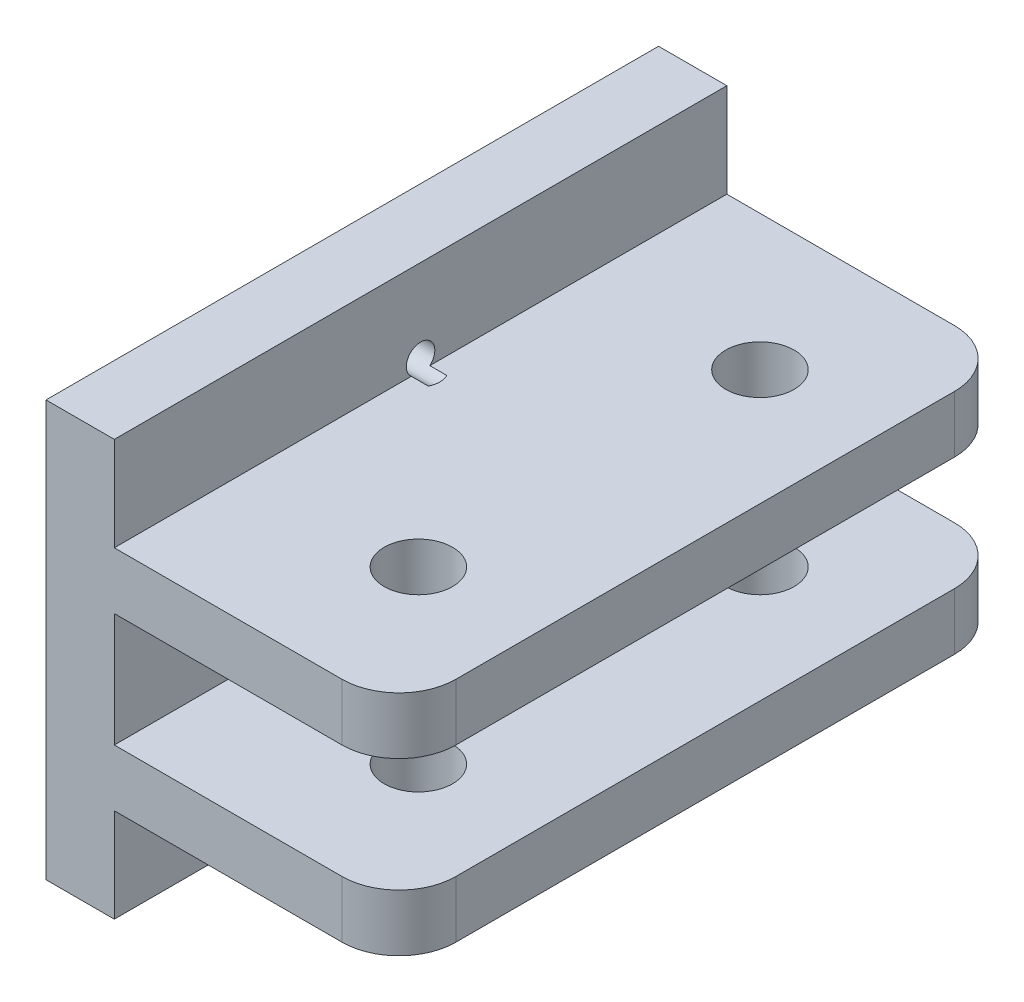
ISO-10303-21;
HEADER;
FILE_DESCRIPTION(('STEP AP214'),'2;1');
FILE_NAME('part.step','',(''),(''),'','','');
FILE_SCHEMA(('AUTOMOTIVE_DESIGN { 1 0 10303 214 1 1 1 1 }'));
ENDSEC;
DATA;
#1=APPLICATION_CONTEXT('core data for automotive mechanical design processes');
#2=APPLICATION_PROTOCOL_DEFINITION('international standard','automotive_design',2000,#1);
#3=PRODUCT_CONTEXT('',#1,'mechanical');
#4=PRODUCT('Part','Part','',(#3));
#5=PRODUCT_RELATED_PRODUCT_CATEGORY('part','',(#4));
#6=PRODUCT_DEFINITION_FORMATION('','',#4);
#7=PRODUCT_DEFINITION_CONTEXT('part definition',#1,'design');
#8=PRODUCT_DEFINITION('design','',#6,#7);
#9=PRODUCT_DEFINITION_SHAPE('','',#8);
#10=(LENGTH_UNIT() NAMED_UNIT(*) SI_UNIT(.MILLI.,.METRE.));
#11=(NAMED_UNIT(*) PLANE_ANGLE_UNIT() SI_UNIT($,.RADIAN.));
#12=(NAMED_UNIT(*) SI_UNIT($,.STERADIAN.) SOLID_ANGLE_UNIT());
#13=UNCERTAINTY_MEASURE_WITH_UNIT(LENGTH_MEASURE(1.E-05),#10,'distance_accuracy_value','');
#14=(GEOMETRIC_REPRESENTATION_CONTEXT(3) GLOBAL_UNCERTAINTY_ASSIGNED_CONTEXT((#13)) GLOBAL_UNIT_ASSIGNED_CONTEXT((#10,
#11,#12)) REPRESENTATION_CONTEXT('',''));
#15=CARTESIAN_POINT('',(0.,0.,0.));
#16=DIRECTION('',(0.,0.,1.));
#17=DIRECTION('',(1.,0.,0.));
#18=AXIS2_PLACEMENT_3D('',#15,#16,#17);
#19=CARTESIAN_POINT('',(31.,0.,0.));
#20=DIRECTION('',(1.,0.,0.));
#21=DIRECTION('',(0.,0.,-1.));
#22=AXIS2_PLACEMENT_3D('',#19,#20,#21);
#23=PLANE('',#22);
#24=DIRECTION('',(0.,0.,1.));
#25=VECTOR('',#24,1.);
#26=CARTESIAN_POINT('',(31.,10.,26.9));
#27=LINE('',#26,#25);
#28=CARTESIAN_POINT('',(31.,10.,-21.9));
#29=VERTEX_POINT('',#28);
#30=CARTESIAN_POINT('',(31.,10.,21.9));
#31=VERTEX_POINT('',#30);
#32=EDGE_CURVE('E252',#29,#31,#27,.T.);
#33=ORIENTED_EDGE('',*,*,#32,.T.);
#34=DIRECTION('',(0.,-1.,0.));
#35=VECTOR('',#34,1.);
#36=CARTESIAN_POINT('',(31.,5.,21.9));
#37=LINE('',#36,#35);
#38=CARTESIAN_POINT('',(31.,5.,21.9));
#39=VERTEX_POINT('',#38);
#40=EDGE_CURVE('E244',#31,#39,#37,.T.);
#41=ORIENTED_EDGE('',*,*,#40,.T.);
#42=DIRECTION('',(0.,0.,1.));
#43=VECTOR('',#42,1.);
#44=CARTESIAN_POINT('',(31.,5.,-26.9));
#45=LINE('',#44,#43);
#46=CARTESIAN_POINT('',(31.,5.,-21.9));
#47=VERTEX_POINT('',#46);
#48=EDGE_CURVE('E269',#47,#39,#45,.T.);
#49=ORIENTED_EDGE('',*,*,#48,.F.);
#50=DIRECTION('',(0.,1.,0.));
#51=VECTOR('',#50,1.);
#52=CARTESIAN_POINT('',(31.,10.,-21.9));
#53=LINE('',#52,#51);
#54=EDGE_CURVE('E242',#47,#29,#53,.T.);
#55=ORIENTED_EDGE('',*,*,#54,.T.);
#56=EDGE_LOOP('',(#33,#41,#49,#55));
#57=FACE_BOUND('',#56,.T.);
#58=ADVANCED_FACE('F39',(#57),#23,.T.);
#59=CARTESIAN_POINT('',(6.,0.,0.));
#60=DIRECTION('',(1.,0.,0.));
#61=DIRECTION('',(0.,0.,-1.));
#62=AXIS2_PLACEMENT_3D('',#59,#60,#61);
#63=PLANE('',#62);
#64=CARTESIAN_POINT('',(6.,-10.95,1.11022302462516E-13));
#65=DIRECTION('',(1.,0.,0.));
#66=DIRECTION('',(0.,0.,-1.));
#67=AXIS2_PLACEMENT_3D('',#64,#65,#66);
#68=CIRCLE('',#67,1.25);
#69=CARTESIAN_POINT('',(6.,-10.,0.812403840463655));
#70=VERTEX_POINT('',#69);
#71=CARTESIAN_POINT('',(6.,-10.,-0.812403840463433));
#72=VERTEX_POINT('',#71);
#73=EDGE_CURVE('E457',#70,#72,#68,.T.);
#74=ORIENTED_EDGE('',*,*,#73,.F.);
#75=DIRECTION('',(0.,0.,-1.));
#76=VECTOR('',#75,1.);
#77=CARTESIAN_POINT('',(6.,-10.,26.9));
#78=LINE('',#77,#76);
#79=CARTESIAN_POINT('',(6.,-10.,26.9));
#80=VERTEX_POINT('',#79);
#81=EDGE_CURVE('E296',#80,#70,#78,.T.);
#82=ORIENTED_EDGE('',*,*,#81,.F.);
#83=DIRECTION('',(0.,-1.,0.));
#84=VECTOR('',#83,1.);
#85=CARTESIAN_POINT('',(6.,-18.25,26.9));
#86=LINE('',#85,#84);
#87=CARTESIAN_POINT('',(6.,-18.25,26.9));
#88=VERTEX_POINT('',#87);
#89=EDGE_CURVE('E312',#80,#88,#86,.T.);
#90=ORIENTED_EDGE('',*,*,#89,.T.);
#91=DIRECTION('',(0.,0.,-1.));
#92=VECTOR('',#91,1.);
#93=CARTESIAN_POINT('',(6.,-18.25,-26.9));
#94=LINE('',#93,#92);
#95=CARTESIAN_POINT('',(6.,-18.25,-26.9));
#96=VERTEX_POINT('',#95);
#97=EDGE_CURVE('E311',#88,#96,#94,.T.);
#98=ORIENTED_EDGE('',*,*,#97,.T.);
#99=DIRECTION('',(0.,1.,0.));
#100=VECTOR('',#99,1.);
#101=CARTESIAN_POINT('',(6.,-18.25,-26.9));
#102=LINE('',#101,#100);
#103=CARTESIAN_POINT('',(6.,-10.,-26.9));
#104=VERTEX_POINT('',#103);
#105=EDGE_CURVE('E314',#96,#104,#102,.T.);
#106=ORIENTED_EDGE('',*,*,#105,.T.);
#107=EDGE_CURVE('E301',#72,#104,#78,.T.);
#108=ORIENTED_EDGE('',*,*,#107,.F.);
#109=EDGE_LOOP('',(#74,#82,#90,#98,#106,#108));
#110=FACE_BOUND('',#109,.T.);
#111=ADVANCED_FACE('F371',(#110),#63,.T.);
#112=CARTESIAN_POINT('',(6.,-18.25,26.9));
#113=DIRECTION('',(0.,0.,-1.));
#114=DIRECTION('',(-1.,0.,0.));
#115=AXIS2_PLACEMENT_3D('',#112,#113,#114);
#116=PLANE('',#115);
#117=DIRECTION('',(-1.,0.,0.));
#118=VECTOR('',#117,1.);
#119=CARTESIAN_POINT('',(31.,-10.,26.9));
#120=LINE('',#119,#118);
#121=CARTESIAN_POINT('',(26.,-10.,26.9));
#122=VERTEX_POINT('',#121);
#123=EDGE_CURVE('E305',#122,#80,#120,.T.);
#124=ORIENTED_EDGE('',*,*,#123,.F.);
#125=DIRECTION('',(0.,-1.,0.));
#126=VECTOR('',#125,1.);
#127=CARTESIAN_POINT('',(26.,-5.,26.9));
#128=LINE('',#127,#126);
#129=CARTESIAN_POINT('',(26.,-5.,26.9));
#130=VERTEX_POINT('',#129);
#131=EDGE_CURVE('E240',#122,#130,#128,.F.);
#132=ORIENTED_EDGE('',*,*,#131,.T.);
#133=DIRECTION('',(1.,0.,0.));
#134=VECTOR('',#133,1.);
#135=CARTESIAN_POINT('',(-48.7214765882647,-5.,26.9));
#136=LINE('',#135,#134);
#137=CARTESIAN_POINT('',(6.,-5.,26.9));
#138=VERTEX_POINT('',#137);
#139=EDGE_CURVE('E273',#138,#130,#136,.T.);
#140=ORIENTED_EDGE('',*,*,#139,.F.);
#141=DIRECTION('',(0.,1.,0.));
#142=VECTOR('',#141,1.);
#143=CARTESIAN_POINT('',(6.,-5.,26.9));
#144=LINE('',#143,#142);
#145=CARTESIAN_POINT('',(6.,5.,26.9));
#146=VERTEX_POINT('',#145);
#147=EDGE_CURVE('E293',#138,#146,#144,.T.);
#148=ORIENTED_EDGE('',*,*,#147,.T.);
#149=DIRECTION('',(1.,0.,0.));
#150=VECTOR('',#149,1.);
#151=CARTESIAN_POINT('',(-48.7214765882647,5.,26.9));
#152=LINE('',#151,#150);
#153=CARTESIAN_POINT('',(26.,5.,26.9));
#154=VERTEX_POINT('',#153);
#155=EDGE_CURVE('E284',#146,#154,#152,.T.);
#156=ORIENTED_EDGE('',*,*,#155,.T.);
#157=DIRECTION('',(0.,-1.,0.));
#158=VECTOR('',#157,1.);
#159=CARTESIAN_POINT('',(26.,10.,26.9));
#160=LINE('',#159,#158);
#161=CARTESIAN_POINT('',(26.,10.,26.9));
#162=VERTEX_POINT('',#161);
#163=EDGE_CURVE('E238',#154,#162,#160,.F.);
#164=ORIENTED_EDGE('',*,*,#163,.T.);
#165=DIRECTION('',(-1.,0.,0.));
#166=VECTOR('',#165,1.);
#167=CARTESIAN_POINT('',(31.,10.,26.9));
#168=LINE('',#167,#166);
#169=CARTESIAN_POINT('',(6.,10.,26.9));
#170=VERTEX_POINT('',#169);
#171=EDGE_CURVE('E262',#162,#170,#168,.T.);
#172=ORIENTED_EDGE('',*,*,#171,.T.);
#173=CARTESIAN_POINT('',(6.,18.25,26.9));
#174=VERTEX_POINT('',#173);
#175=EDGE_CURVE('E308',#174,#170,#86,.T.);
#176=ORIENTED_EDGE('',*,*,#175,.F.);
#177=DIRECTION('',(-1.,0.,0.));
#178=VECTOR('',#177,1.);
#179=CARTESIAN_POINT('',(6.,18.25,26.9));
#180=LINE('',#179,#178);
#181=CARTESIAN_POINT('',(0.,18.25,26.9));
#182=VERTEX_POINT('',#181);
#183=EDGE_CURVE('E319',#174,#182,#180,.T.);
#184=ORIENTED_EDGE('',*,*,#183,.T.);
#185=DIRECTION('',(0.,-1.,0.));
#186=VECTOR('',#185,1.);
#187=CARTESIAN_POINT('',(0.,-18.25,26.9));
#188=LINE('',#187,#186);
#189=CARTESIAN_POINT('',(0.,-18.25,26.9));
#190=VERTEX_POINT('',#189);
#191=EDGE_CURVE('E261',#182,#190,#188,.T.);
#192=ORIENTED_EDGE('',*,*,#191,.T.);
#193=DIRECTION('',(-1.,0.,0.));
#194=VECTOR('',#193,1.);
#195=CARTESIAN_POINT('',(6.,-18.25,26.9));
#196=LINE('',#195,#194);
#197=EDGE_CURVE('E336',#88,#190,#196,.T.);
#198=ORIENTED_EDGE('',*,*,#197,.F.);
#199=ORIENTED_EDGE('',*,*,#89,.F.);
#200=EDGE_LOOP('',(#124,#132,#140,#148,#156,#164,#172,#176,#184,#192,#198,#199));
#201=FACE_BOUND('',#200,.T.);
#202=ADVANCED_FACE('F383',(#201),#116,.F.);
#203=CARTESIAN_POINT('',(6.,-18.25,-26.9));
#204=DIRECTION('',(0.,1.,0.));
#205=DIRECTION('',(0.,0.,1.));
#206=AXIS2_PLACEMENT_3D('',#203,#204,#205);
#207=PLANE('',#206);
#208=DIRECTION('',(0.,0.,-1.));
#209=VECTOR('',#208,1.);
#210=CARTESIAN_POINT('',(0.,-18.25,-26.9));
#211=LINE('',#210,#209);
#212=CARTESIAN_POINT('',(0.,-18.25,-26.9));
#213=VERTEX_POINT('',#212);
#214=EDGE_CURVE('E322',#190,#213,#211,.T.);
#215=ORIENTED_EDGE('',*,*,#214,.T.);
#216=DIRECTION('',(-1.,0.,0.));
#217=VECTOR('',#216,1.);
#218=CARTESIAN_POINT('',(6.,-18.25,-26.9));
#219=LINE('',#218,#217);
#220=EDGE_CURVE('E333',#96,#213,#219,.T.);
#221=ORIENTED_EDGE('',*,*,#220,.F.);
#222=ORIENTED_EDGE('',*,*,#97,.F.);
#223=ORIENTED_EDGE('',*,*,#197,.T.);
#224=EDGE_LOOP('',(#215,#221,#222,#223));
#225=FACE_BOUND('',#224,.T.);
#226=ADVANCED_FACE('F380',(#225),#207,.F.);
#227=CARTESIAN_POINT('',(6.,-18.25,-26.9));
#228=DIRECTION('',(0.,0.,1.));
#229=DIRECTION('',(1.,0.,0.));
#230=AXIS2_PLACEMENT_3D('',#227,#228,#229);
#231=PLANE('',#230);
#232=DIRECTION('',(1.,0.,0.));
#233=VECTOR('',#232,1.);
#234=CARTESIAN_POINT('',(-48.7214765882647,-5.,-26.9));
#235=LINE('',#234,#233);
#236=CARTESIAN_POINT('',(6.,-5.,-26.9));
#237=VERTEX_POINT('',#236);
#238=CARTESIAN_POINT('',(26.,-5.,-26.9));
#239=VERTEX_POINT('',#238);
#240=EDGE_CURVE('E277',#237,#239,#235,.T.);
#241=ORIENTED_EDGE('',*,*,#240,.T.);
#242=DIRECTION('',(0.,1.,0.));
#243=VECTOR('',#242,1.);
#244=CARTESIAN_POINT('',(26.,-10.,-26.9));
#245=LINE('',#244,#243);
#246=CARTESIAN_POINT('',(26.,-10.,-26.9));
#247=VERTEX_POINT('',#246);
#248=EDGE_CURVE('E232',#239,#247,#245,.F.);
#249=ORIENTED_EDGE('',*,*,#248,.T.);
#250=DIRECTION('',(-1.,0.,0.));
#251=VECTOR('',#250,1.);
#252=CARTESIAN_POINT('',(31.,-10.,-26.9));
#253=LINE('',#252,#251);
#254=EDGE_CURVE('E299',#247,#104,#253,.T.);
#255=ORIENTED_EDGE('',*,*,#254,.T.);
#256=ORIENTED_EDGE('',*,*,#105,.F.);
#257=ORIENTED_EDGE('',*,*,#220,.T.);
#258=DIRECTION('',(0.,1.,0.));
#259=VECTOR('',#258,1.);
#260=CARTESIAN_POINT('',(0.,-18.25,-26.9));
#261=LINE('',#260,#259);
#262=CARTESIAN_POINT('',(0.,18.25,-26.9));
#263=VERTEX_POINT('',#262);
#264=EDGE_CURVE('E324',#213,#263,#261,.T.);
#265=ORIENTED_EDGE('',*,*,#264,.T.);
#266=DIRECTION('',(-1.,0.,0.));
#267=VECTOR('',#266,1.);
#268=CARTESIAN_POINT('',(6.,18.25,-26.9));
#269=LINE('',#268,#267);
#270=CARTESIAN_POINT('',(6.,18.25,-26.9));
#271=VERTEX_POINT('',#270);
#272=EDGE_CURVE('E330',#271,#263,#269,.T.);
#273=ORIENTED_EDGE('',*,*,#272,.F.);
#274=CARTESIAN_POINT('',(6.,10.,-26.9));
#275=VERTEX_POINT('',#274);
#276=EDGE_CURVE('E260',#275,#271,#102,.T.);
#277=ORIENTED_EDGE('',*,*,#276,.F.);
#278=DIRECTION('',(-1.,0.,0.));
#279=VECTOR('',#278,1.);
#280=CARTESIAN_POINT('',(31.,10.,-26.9));
#281=LINE('',#280,#279);
#282=CARTESIAN_POINT('',(26.,10.,-26.9));
#283=VERTEX_POINT('',#282);
#284=EDGE_CURVE('E251',#283,#275,#281,.T.);
#285=ORIENTED_EDGE('',*,*,#284,.F.);
#286=DIRECTION('',(0.,1.,0.));
#287=VECTOR('',#286,1.);
#288=CARTESIAN_POINT('',(26.,5.,-26.9));
#289=LINE('',#288,#287);
#290=CARTESIAN_POINT('',(26.,5.,-26.9));
#291=VERTEX_POINT('',#290);
#292=EDGE_CURVE('E230',#283,#291,#289,.F.);
#293=ORIENTED_EDGE('',*,*,#292,.T.);
#294=DIRECTION('',(1.,0.,0.));
#295=VECTOR('',#294,1.);
#296=CARTESIAN_POINT('',(-48.7214765882647,5.,-26.9));
#297=LINE('',#296,#295);
#298=CARTESIAN_POINT('',(6.,5.,-26.9));
#299=VERTEX_POINT('',#298);
#300=EDGE_CURVE('E270',#299,#291,#297,.T.);
#301=ORIENTED_EDGE('',*,*,#300,.F.);
#302=DIRECTION('',(0.,-1.,0.));
#303=VECTOR('',#302,1.);
#304=CARTESIAN_POINT('',(6.,-5.,-26.9));
#305=LINE('',#304,#303);
#306=EDGE_CURVE('E287',#299,#237,#305,.T.);
#307=ORIENTED_EDGE('',*,*,#306,.T.);
#308=EDGE_LOOP('',(#241,#249,#255,#256,#257,#265,#273,#277,#285,#293,#301,#307));
#309=FACE_BOUND('',#308,.T.);
#310=ADVANCED_FACE('F256',(#309),#231,.F.);
#311=CARTESIAN_POINT('',(6.,18.25,-26.9));
#312=DIRECTION('',(0.,-1.,0.));
#313=DIRECTION('',(0.,0.,-1.));
#314=AXIS2_PLACEMENT_3D('',#311,#312,#313);
#315=PLANE('',#314);
#316=DIRECTION('',(0.,0.,1.));
#317=VECTOR('',#316,1.);
#318=CARTESIAN_POINT('',(0.,18.25,-26.9));
#319=LINE('',#318,#317);
#320=EDGE_CURVE('E326',#263,#182,#319,.T.);
#321=ORIENTED_EDGE('',*,*,#320,.T.);
#322=ORIENTED_EDGE('',*,*,#183,.F.);
#323=DIRECTION('',(0.,0.,1.));
#324=VECTOR('',#323,1.);
#325=CARTESIAN_POINT('',(6.,18.25,-26.9));
#326=LINE('',#325,#324);
#327=EDGE_CURVE('E317',#271,#174,#326,.T.);
#328=ORIENTED_EDGE('',*,*,#327,.F.);
#329=ORIENTED_EDGE('',*,*,#272,.T.);
#330=EDGE_LOOP('',(#321,#322,#328,#329));
#331=FACE_BOUND('',#330,.T.);
#332=ADVANCED_FACE('F369',(#331),#315,.F.);
#333=CARTESIAN_POINT('',(6.,10.95,0.));
#334=DIRECTION('',(1.,0.,0.));
#335=DIRECTION('',(0.,0.,-1.));
#336=AXIS2_PLACEMENT_3D('',#333,#334,#335);
#337=CIRCLE('',#336,1.25);
#338=CARTESIAN_POINT('',(6.,10.,-0.812403840463621));
#339=VERTEX_POINT('',#338);
#340=CARTESIAN_POINT('',(6.,10.,0.812403840463677));
#341=VERTEX_POINT('',#340);
#342=EDGE_CURVE('E189',#339,#341,#337,.T.);
#343=ORIENTED_EDGE('',*,*,#342,.F.);
#344=DIRECTION('',(0.,0.,1.));
#345=VECTOR('',#344,1.);
#346=CARTESIAN_POINT('',(6.,10.,26.9));
#347=LINE('',#346,#345);
#348=EDGE_CURVE('E195',#275,#339,#347,.T.);
#349=ORIENTED_EDGE('',*,*,#348,.F.);
#350=ORIENTED_EDGE('',*,*,#276,.T.);
#351=ORIENTED_EDGE('',*,*,#327,.T.);
#352=ORIENTED_EDGE('',*,*,#175,.T.);
#353=EDGE_CURVE('E292',#341,#170,#347,.T.);
#354=ORIENTED_EDGE('',*,*,#353,.F.);
#355=EDGE_LOOP('',(#343,#349,#350,#351,#352,#354));
#356=FACE_BOUND('',#355,.T.);
#357=ADVANCED_FACE('F366',(#356),#63,.T.);
#358=CARTESIAN_POINT('',(0.,0.,0.));
#359=DIRECTION('',(1.,0.,0.));
#360=DIRECTION('',(0.,0.,-1.));
#361=AXIS2_PLACEMENT_3D('',#358,#359,#360);
#362=PLANE('',#361);
#363=CARTESIAN_POINT('',(0.,0.,-10.95));
#364=DIRECTION('',(-1.,0.,0.));
#365=DIRECTION('',(0.,0.,1.));
#366=AXIS2_PLACEMENT_3D('',#363,#364,#365);
#367=CIRCLE('',#366,1.25);
#368=CARTESIAN_POINT('',(0.,0.,-9.69999999999996));
#369=VERTEX_POINT('',#368);
#370=EDGE_CURVE('E210',#369,#369,#367,.T.);
#371=ORIENTED_EDGE('',*,*,#370,.F.);
#372=EDGE_LOOP('',(#371));
#373=FACE_BOUND('',#372,.T.);
#374=CARTESIAN_POINT('',(0.,10.95,0.));
#375=DIRECTION('',(-1.,0.,0.));
#376=DIRECTION('',(0.,0.,1.));
#377=AXIS2_PLACEMENT_3D('',#374,#375,#376);
#378=CIRCLE('',#377,1.25);
#379=CARTESIAN_POINT('',(0.,10.95,1.25000000000003));
#380=VERTEX_POINT('',#379);
#381=EDGE_CURVE('E190',#380,#380,#378,.T.);
#382=ORIENTED_EDGE('',*,*,#381,.F.);
#383=EDGE_LOOP('',(#382));
#384=FACE_BOUND('',#383,.T.);
#385=CARTESIAN_POINT('',(0.,0.,0.));
#386=DIRECTION('',(-1.,0.,0.));
#387=DIRECTION('',(0.,0.,1.));
#388=AXIS2_PLACEMENT_3D('',#385,#386,#387);
#389=CIRCLE('',#388,1.25);
#390=CARTESIAN_POINT('',(0.,0.,1.25));
#391=VERTEX_POINT('',#390);
#392=EDGE_CURVE('E468',#391,#391,#389,.T.);
#393=ORIENTED_EDGE('',*,*,#392,.F.);
#394=EDGE_LOOP('',(#393));
#395=FACE_BOUND('',#394,.T.);
#396=CARTESIAN_POINT('',(0.,-10.95,1.11022302462516E-13));
#397=DIRECTION('',(-1.,0.,0.));
#398=DIRECTION('',(0.,0.,1.));
#399=AXIS2_PLACEMENT_3D('',#396,#397,#398);
#400=CIRCLE('',#399,1.25);
#401=CARTESIAN_POINT('',(0.,-10.95,1.25000000000011));
#402=VERTEX_POINT('',#401);
#403=EDGE_CURVE('E467',#402,#402,#400,.T.);
#404=ORIENTED_EDGE('',*,*,#403,.F.);
#405=EDGE_LOOP('',(#404));
#406=FACE_BOUND('',#405,.T.);
#407=CARTESIAN_POINT('',(0.,0.,10.95));
#408=DIRECTION('',(-1.,0.,0.));
#409=DIRECTION('',(0.,0.,1.));
#410=AXIS2_PLACEMENT_3D('',#407,#408,#409);
#411=CIRCLE('',#410,1.25);
#412=CARTESIAN_POINT('',(0.,0.,12.2));
#413=VERTEX_POINT('',#412);
#414=EDGE_CURVE('E481',#413,#413,#411,.T.);
#415=ORIENTED_EDGE('',*,*,#414,.F.);
#416=EDGE_LOOP('',(#415));
#417=FACE_BOUND('',#416,.T.);
#418=ORIENTED_EDGE('',*,*,#191,.F.);
#419=ORIENTED_EDGE('',*,*,#320,.F.);
#420=ORIENTED_EDGE('',*,*,#264,.F.);
#421=ORIENTED_EDGE('',*,*,#214,.F.);
#422=EDGE_LOOP('',(#418,#419,#420,#421));
#423=FACE_BOUND('',#422,.T.);
#424=ADVANCED_FACE('F364',(#373,#384,#395,#406,#417,#423),#362,.F.);
#425=CARTESIAN_POINT('',(31.,10.,26.9));
#426=DIRECTION('',(0.,-1.,0.));
#427=DIRECTION('',(0.,0.,-1.));
#428=AXIS2_PLACEMENT_3D('',#425,#426,#427);
#429=PLANE('',#428);
#430=CARTESIAN_POINT('',(20.8060558819451,10.,15.));
#431=DIRECTION('',(0.,-1.,0.));
#432=DIRECTION('',(0.,0.,-1.));
#433=AXIS2_PLACEMENT_3D('',#430,#431,#432);
#434=CIRCLE('',#433,3.);
#435=CARTESIAN_POINT('',(20.8060558819451,10.,12.));
#436=VERTEX_POINT('',#435);
#437=EDGE_CURVE('E509',#436,#436,#434,.T.);
#438=ORIENTED_EDGE('',*,*,#437,.T.);
#439=EDGE_LOOP('',(#438));
#440=FACE_BOUND('',#439,.T.);
#441=CARTESIAN_POINT('',(20.8060558819451,10.,-15.));
#442=DIRECTION('',(0.,-1.,0.));
#443=DIRECTION('',(0.,0.,-1.));
#444=AXIS2_PLACEMENT_3D('',#441,#442,#443);
#445=CIRCLE('',#444,3.);
#446=CARTESIAN_POINT('',(20.8060558819451,10.,-18.));
#447=VERTEX_POINT('',#446);
#448=EDGE_CURVE('E220',#447,#447,#445,.T.);
#449=ORIENTED_EDGE('',*,*,#448,.T.);
#450=EDGE_LOOP('',(#449));
#451=FACE_BOUND('',#450,.T.);
#452=ORIENTED_EDGE('',*,*,#171,.F.);
#453=CARTESIAN_POINT('',(26.,10.,21.9));
#454=DIRECTION('',(0.,-1.,0.));
#455=DIRECTION('',(0.,0.,-1.));
#456=AXIS2_PLACEMENT_3D('',#453,#454,#455);
#457=CIRCLE('',#456,5.);
#458=EDGE_CURVE('E11',#162,#31,#457,.F.);
#459=ORIENTED_EDGE('',*,*,#458,.T.);
#460=ORIENTED_EDGE('',*,*,#32,.F.);
#461=CARTESIAN_POINT('',(26.,10.,-21.9));
#462=DIRECTION('',(0.,-1.,0.));
#463=DIRECTION('',(0.,0.,-1.));
#464=AXIS2_PLACEMENT_3D('',#461,#462,#463);
#465=CIRCLE('',#464,5.);
#466=EDGE_CURVE('E47',#29,#283,#465,.F.);
#467=ORIENTED_EDGE('',*,*,#466,.T.);
#468=ORIENTED_EDGE('',*,*,#284,.T.);
#469=ORIENTED_EDGE('',*,*,#348,.T.);
#470=DIRECTION('',(-1.,0.,0.));
#471=VECTOR('',#470,1.);
#472=CARTESIAN_POINT('',(0.,10.,-0.812403840463621));
#473=LINE('',#472,#471);
#474=CARTESIAN_POINT('',(7.5,10.,-0.81240384046362));
#475=VERTEX_POINT('',#474);
#476=EDGE_CURVE('E182',#339,#475,#473,.F.);
#477=ORIENTED_EDGE('',*,*,#476,.T.);
#478=CARTESIAN_POINT('',(4.45536286791043,10.,-6.24528581617007));
#479=CARTESIAN_POINT('',(4.56346927765531,10.,-6.06328880944212));
#480=CARTESIAN_POINT('',(4.67150356178646,10.,-5.88124890023268));
#481=CARTESIAN_POINT('',(4.88741765311982,10.,-5.51695361698977));
#482=CARTESIAN_POINT('',(4.99529735512497,10.,-5.33469818061545));
#483=CARTESIAN_POINT('',(5.21178680447321,10.,-4.96832671647477));
#484=CARTESIAN_POINT('',(5.32039398987177,10.,-4.78420917347594));
#485=CARTESIAN_POINT('',(5.53715913752213,10.,-4.41583394193733));
#486=CARTESIAN_POINT('',(5.64531729723408,10.,-4.23157636950006));
#487=CARTESIAN_POINT('',(5.91256750457755,10.,-3.77473577218286));
#488=CARTESIAN_POINT('',(6.07133571623787,10.,-3.50196249179493));
#489=CARTESIAN_POINT('',(6.30789394346261,10.,-3.09155155168428));
#490=CARTESIAN_POINT('',(6.3865516424984,10.,-2.95441441113683));
#491=CARTESIAN_POINT('',(6.54298412671253,10.,-2.67967006781227));
#492=CARTESIAN_POINT('',(6.62075907462558,10.,-2.54206295796473));
#493=CARTESIAN_POINT('',(6.77438777525458,10.,-2.26714247944336));
#494=CARTESIAN_POINT('',(6.85025160372422,10.,-2.12983474676925));
#495=CARTESIAN_POINT('',(6.99989718414111,10.,-1.85394691836817));
#496=CARTESIAN_POINT('',(7.07367738335771,10.,-1.71536597071095));
#497=CARTESIAN_POINT('',(7.18128945939188,10.,-1.50620948330716));
#498=CARTESIAN_POINT('',(7.2165941047874,10.,-1.43639396916513));
#499=CARTESIAN_POINT('',(7.28581765015032,10.,-1.29608147462139));
#500=CARTESIAN_POINT('',(7.31973666076189,10.,-1.22558454918905));
#501=CARTESIAN_POINT('',(7.38554862111919,10.,-1.08374791592926));
#502=CARTESIAN_POINT('',(7.41744392158242,10.,-1.01240930447704));
#503=CARTESIAN_POINT('',(7.47828535275741,10.,-0.868492807332919));
#504=CARTESIAN_POINT('',(7.50723279784288,10.,-0.795915490951771));
#505=CARTESIAN_POINT('',(7.54332131728871,10.,-0.696683859987229));
#506=CARTESIAN_POINT('',(7.5524376834575,10.,-0.670747216695313));
#507=CARTESIAN_POINT('',(7.57001680455393,10.,-0.618648521098755));
#508=CARTESIAN_POINT('',(7.57847947117218,10.,-0.592486438867974));
#509=CARTESIAN_POINT('',(7.59464563726653,10.,-0.539933642851709));
#510=CARTESIAN_POINT('',(7.60234930887792,10.,-0.513542982390253));
#511=CARTESIAN_POINT('',(7.61688317579563,10.,-0.460523339860514));
#512=CARTESIAN_POINT('',(7.6237133750474,10.,-0.4338943588693));
#513=CARTESIAN_POINT('',(7.64233268360766,10.,-0.355223415367418));
#514=CARTESIAN_POINT('',(7.65274222180109,10.,-0.302840704708201));
#515=CARTESIAN_POINT('',(7.66887788340232,10.,-0.197339967886298));
#516=CARTESIAN_POINT('',(7.67460379125306,10.,-0.144221907994667));
#517=CARTESIAN_POINT('',(7.68122189283448,10.,-0.0284175734054826));
#518=CARTESIAN_POINT('',(7.68110442730663,10.,0.0343315697494091));
#519=CARTESIAN_POINT('',(7.6734953862593,10.,0.159355871368653));
#520=CARTESIAN_POINT('',(7.66600326655384,10.,0.221630994512663));
#521=CARTESIAN_POINT('',(7.64450466570069,10.,0.346873486935557));
#522=CARTESIAN_POINT('',(7.63031483917135,10.,0.409808206565808));
#523=CARTESIAN_POINT('',(7.60534364919671,10.,0.503202665019396));
#524=CARTESIAN_POINT('',(7.59640109027855,10.,0.534178699563556));
#525=CARTESIAN_POINT('',(7.57747159847859,10.,0.59580928518025));
#526=CARTESIAN_POINT('',(7.56748472666313,10.,0.626463854935272));
#527=CARTESIAN_POINT('',(7.53815090394029,10.,0.712302185366289));
#528=CARTESIAN_POINT('',(7.51780175888441,10.,0.767142403639946));
#529=CARTESIAN_POINT('',(7.47501263702329,10.,0.876006183787648));
#530=CARTESIAN_POINT('',(7.45257205694843,10.,0.930029504774364));
#531=CARTESIAN_POINT('',(7.40613891090688,10.,1.03746003625905));
#532=CARTESIAN_POINT('',(7.38214493704522,10.,1.09086663465444));
#533=CARTESIAN_POINT('',(7.33301147159142,10.,1.19715193729685));
#534=CARTESIAN_POINT('',(7.30787189463098,10.,1.25003060184408));
#535=CARTESIAN_POINT('',(7.23099390476474,10.,1.4084053974181));
#536=CARTESIAN_POINT('',(7.17796072877102,10.,1.51327136119513));
#537=CARTESIAN_POINT('',(7.06987143759966,10.,1.72186921374031));
#538=CARTESIAN_POINT('',(7.01481645213456,10.,1.82560169504336));
#539=CARTESIAN_POINT('',(6.91062809309575,10.,2.01888448801067));
#540=CARTESIAN_POINT('',(6.86165719819798,10.,2.10852256923869));
#541=CARTESIAN_POINT('',(6.76298845820177,10.,2.28741556907024));
#542=CARTESIAN_POINT('',(6.71329049777766,10.,2.37667042391821));
#543=CARTESIAN_POINT('',(6.61373741993282,10.,2.55422743429682));
#544=CARTESIAN_POINT('',(6.56388616762236,10.,2.64253176014127));
#545=CARTESIAN_POINT('',(6.46379393619147,10.,2.81889739093403));
#546=CARTESIAN_POINT('',(6.41355303223316,10.,2.90695873851679));
#547=CARTESIAN_POINT('',(6.3631720448529,10.,2.99493914553303));
#548=B_SPLINE_CURVE_WITH_KNOTS('',3,(#478,#479,#480,#481,#482,#483,#484,#485,#486,#487,#488,
#489,#490,#491,#492,#493,#494,#495,#496,#497,#498,#499,#500,#501,#502,#503,#504,#505,#506,#507,
#508,#509,#510,#511,#512,#513,#514,#515,#516,#517,#518,#519,#520,#521,#522,#523,#524,#525,#526,
#527,#528,#529,#530,#531,#532,#533,#534,#535,#536,#537,#538,#539,#540,#541,#542,#543,#544,#545,
#546,#547),.UNSPECIFIED.,.F.,.F.,(4,2,2,2,2,2,2,2,2,2,2,2,2,2,2,2,2,2,2,2,2,2,2,2,2,2,2,2,2,2,2,
2,2,2,4),(0.,0.635050558782489,1.27042093767502,1.9117106249956,2.55267966676926,
3.49951580688339,3.97379526448551,4.44798582044341,4.91859363511463,5.38954335944675,
5.62423674091807,5.85891134513687,6.09330816566267,6.32760001275508,6.41006942394651,
6.49254995665863,6.57501174003531,6.6574731509209,6.81750874722642,6.97755170851548,
7.16533037415319,7.35312289727827,7.54638394801294,7.64309375687883,7.73979791378444,
7.9152143325219,8.09068150725345,8.2663100027982,8.44195160733435,8.7944460476098,
9.1467464375264,9.45316985578183,9.75964241694233,10.0638537191874,10.3680077317429),.UNSPECIFIED.);
#549=CARTESIAN_POINT('',(7.50000000000006,10.,0.812403840463851));
#550=VERTEX_POINT('',#549);
#551=EDGE_CURVE('E175',#475,#550,#548,.T.);
#552=ORIENTED_EDGE('',*,*,#551,.T.);
#553=DIRECTION('',(-1.,0.,0.));
#554=VECTOR('',#553,1.);
#555=CARTESIAN_POINT('',(0.,10.,0.812403840463677));
#556=LINE('',#555,#554);
#557=EDGE_CURVE('E188',#550,#341,#556,.T.);
#558=ORIENTED_EDGE('',*,*,#557,.T.);
#559=ORIENTED_EDGE('',*,*,#353,.T.);
#560=EDGE_LOOP('',(#452,#459,#460,#467,#468,#469,#477,#552,#558,#559));
#561=FACE_BOUND('',#560,.T.);
#562=ADVANCED_FACE('F193',(#440,#451,#561),#429,.F.);
#563=CARTESIAN_POINT('',(31.,-10.,26.9));
#564=DIRECTION('',(0.,1.,0.));
#565=DIRECTION('',(0.,0.,1.));
#566=AXIS2_PLACEMENT_3D('',#563,#564,#565);
#567=PLANE('',#566);
#568=CARTESIAN_POINT('',(20.8060558819451,-10.,15.));
#569=DIRECTION('',(0.,-1.,0.));
#570=DIRECTION('',(0.,0.,-1.));
#571=AXIS2_PLACEMENT_3D('',#568,#569,#570);
#572=CIRCLE('',#571,3.);
#573=CARTESIAN_POINT('',(20.8060558819451,-10.,12.));
#574=VERTEX_POINT('',#573);
#575=EDGE_CURVE('E215',#574,#574,#572,.T.);
#576=ORIENTED_EDGE('',*,*,#575,.F.);
#577=EDGE_LOOP('',(#576));
#578=FACE_BOUND('',#577,.T.);
#579=CARTESIAN_POINT('',(20.8060558819451,-10.,-15.));
#580=DIRECTION('',(0.,-1.,0.));
#581=DIRECTION('',(0.,0.,-1.));
#582=AXIS2_PLACEMENT_3D('',#579,#580,#581);
#583=CIRCLE('',#582,3.);
#584=CARTESIAN_POINT('',(20.8060558819451,-10.,-18.));
#585=VERTEX_POINT('',#584);
#586=EDGE_CURVE('E563',#585,#585,#583,.T.);
#587=ORIENTED_EDGE('',*,*,#586,.F.);
#588=EDGE_LOOP('',(#587));
#589=FACE_BOUND('',#588,.T.);
#590=ORIENTED_EDGE('',*,*,#254,.F.);
#591=CARTESIAN_POINT('',(26.,-10.,-21.9));
#592=DIRECTION('',(0.,1.,0.));
#593=DIRECTION('',(0.,0.,1.));
#594=AXIS2_PLACEMENT_3D('',#591,#592,#593);
#595=CIRCLE('',#594,5.);
#596=CARTESIAN_POINT('',(31.,-10.,-21.9));
#597=VERTEX_POINT('',#596);
#598=EDGE_CURVE('E236',#247,#597,#595,.F.);
#599=ORIENTED_EDGE('',*,*,#598,.T.);
#600=DIRECTION('',(0.,0.,-1.));
#601=VECTOR('',#600,1.);
#602=CARTESIAN_POINT('',(31.,-10.,26.9));
#603=LINE('',#602,#601);
#604=CARTESIAN_POINT('',(31.,-10.,21.9));
#605=VERTEX_POINT('',#604);
#606=EDGE_CURVE('E295',#605,#597,#603,.T.);
#607=ORIENTED_EDGE('',*,*,#606,.F.);
#608=CARTESIAN_POINT('',(26.,-10.,21.9));
#609=DIRECTION('',(0.,1.,0.));
#610=DIRECTION('',(0.,0.,1.));
#611=AXIS2_PLACEMENT_3D('',#608,#609,#610);
#612=CIRCLE('',#611,5.);
#613=EDGE_CURVE('E234',#605,#122,#612,.F.);
#614=ORIENTED_EDGE('',*,*,#613,.T.);
#615=ORIENTED_EDGE('',*,*,#123,.T.);
#616=ORIENTED_EDGE('',*,*,#81,.T.);
#617=DIRECTION('',(-1.,0.,0.));
#618=VECTOR('',#617,1.);
#619=CARTESIAN_POINT('',(0.,-10.,0.812403840463655));
#620=LINE('',#619,#618);
#621=CARTESIAN_POINT('',(7.5,-10.,0.812403840463653));
#622=VERTEX_POINT('',#621);
#623=EDGE_CURVE('E348',#70,#622,#620,.F.);
#624=ORIENTED_EDGE('',*,*,#623,.T.);
#625=CARTESIAN_POINT('',(4.45536286791038,-10.,-6.24528581617005));
#626=CARTESIAN_POINT('',(4.56346927765526,-10.,-6.0632888094421));
#627=CARTESIAN_POINT('',(4.67150356178642,-10.,-5.88124890023265));
#628=CARTESIAN_POINT('',(4.88741765311978,-10.,-5.51695361698973));
#629=CARTESIAN_POINT('',(4.99529735512494,-10.,-5.33469818061541));
#630=CARTESIAN_POINT('',(5.21178680447318,-10.,-4.96832671647472));
#631=CARTESIAN_POINT('',(5.32039398987175,-10.,-4.78420917347589));
#632=CARTESIAN_POINT('',(5.53715913752211,-10.,-4.41583394193727));
#633=CARTESIAN_POINT('',(5.64531729723406,-10.,-4.23157636949999));
#634=CARTESIAN_POINT('',(5.91256750457753,-10.,-3.77473577218279));
#635=CARTESIAN_POINT('',(6.07133571623785,-10.,-3.50196249179485));
#636=CARTESIAN_POINT('',(6.30789394346259,-10.,-3.0915515516842));
#637=CARTESIAN_POINT('',(6.38655164249838,-10.,-2.95441441113675));
#638=CARTESIAN_POINT('',(6.54298412671252,-10.,-2.67967006781219));
#639=CARTESIAN_POINT('',(6.62075907462556,-10.,-2.54206295796464));
#640=CARTESIAN_POINT('',(6.77438777525456,-10.,-2.26714247944327));
#641=CARTESIAN_POINT('',(6.8502516037242,-10.,-2.12983474676916));
#642=CARTESIAN_POINT('',(6.99989718414109,-10.,-1.85394691836809));
#643=CARTESIAN_POINT('',(7.07367738335769,-10.,-1.71536597071086));
#644=CARTESIAN_POINT('',(7.18128945939185,-10.,-1.50620948330707));
#645=CARTESIAN_POINT('',(7.21659410478737,-10.,-1.43639396916504));
#646=CARTESIAN_POINT('',(7.2858176501503,-10.,-1.29608147462129));
#647=CARTESIAN_POINT('',(7.31973666076187,-10.,-1.22558454918896));
#648=CARTESIAN_POINT('',(7.38554862111916,-10.,-1.08374791592916));
#649=CARTESIAN_POINT('',(7.41744392158238,-10.,-1.01240930447694));
#650=CARTESIAN_POINT('',(7.47828535275737,-10.,-0.868492807332825));
#651=CARTESIAN_POINT('',(7.50723279784284,-10.,-0.795915490951677));
#652=CARTESIAN_POINT('',(7.54332131728867,-10.,-0.696683859987132));
#653=CARTESIAN_POINT('',(7.55243768345746,-10.,-0.670747216695214));
#654=CARTESIAN_POINT('',(7.57001680455389,-10.,-0.618648521098653));
#655=CARTESIAN_POINT('',(7.57847947117214,-10.,-0.59248643886787));
#656=CARTESIAN_POINT('',(7.59464563726649,-10.,-0.539933642851602));
#657=CARTESIAN_POINT('',(7.60234930887788,-10.,-0.513542982390145));
#658=CARTESIAN_POINT('',(7.61688317579559,-10.,-0.460523339860403));
#659=CARTESIAN_POINT('',(7.62371337504736,-10.,-0.433894358869187));
#660=CARTESIAN_POINT('',(7.64233268360761,-10.,-0.3552234153673));
#661=CARTESIAN_POINT('',(7.65274222180105,-10.,-0.302840704708079));
#662=CARTESIAN_POINT('',(7.66887788340227,-10.,-0.19733996788617));
#663=CARTESIAN_POINT('',(7.67460379125301,-10.,-0.144221907994536));
#664=CARTESIAN_POINT('',(7.68122189283443,-10.,-0.0284175734053479));
#665=CARTESIAN_POINT('',(7.68110442730658,-10.,0.0343315697495441));
#666=CARTESIAN_POINT('',(7.67349538625924,-10.,0.159355871368788));
#667=CARTESIAN_POINT('',(7.66600326655378,-10.,0.221630994512797));
#668=CARTESIAN_POINT('',(7.64450466570063,-10.,0.346873486935691));
#669=CARTESIAN_POINT('',(7.63031483917128,-10.,0.409808206565941));
#670=CARTESIAN_POINT('',(7.60534364919665,-10.,0.50320266501953));
#671=CARTESIAN_POINT('',(7.59640109027849,-10.,0.53417869956369));
#672=CARTESIAN_POINT('',(7.57747159847853,-10.,0.595809285180383));
#673=CARTESIAN_POINT('',(7.56748472666307,-10.,0.626463854935406));
#674=CARTESIAN_POINT('',(7.53815090394023,-10.,0.712302185366429));
#675=CARTESIAN_POINT('',(7.51780175888435,-10.,0.767142403640092));
#676=CARTESIAN_POINT('',(7.47501263702322,-10.,0.876006183787805));
#677=CARTESIAN_POINT('',(7.45257205694836,-10.,0.930029504774527));
#678=CARTESIAN_POINT('',(7.4061389109068,-10.,1.03746003625922));
#679=CARTESIAN_POINT('',(7.38214493704514,-10.,1.09086663465462));
#680=CARTESIAN_POINT('',(7.33301147159133,-10.,1.19715193729704));
#681=CARTESIAN_POINT('',(7.30787189463089,-10.,1.25003060184427));
#682=CARTESIAN_POINT('',(7.23099390476465,-10.,1.40840539741832));
#683=CARTESIAN_POINT('',(7.17796072877092,-10.,1.51327136119536));
#684=CARTESIAN_POINT('',(7.06987143759954,-10.,1.72186921374055));
#685=CARTESIAN_POINT('',(7.01481645213444,-10.,1.82560169504361));
#686=CARTESIAN_POINT('',(6.91062809309563,-10.,2.01888448801095));
#687=CARTESIAN_POINT('',(6.86165719819785,-10.,2.10852256923898));
#688=CARTESIAN_POINT('',(6.76298845820163,-10.,2.28741556907055));
#689=CARTESIAN_POINT('',(6.71329049777751,-10.,2.37667042391853));
#690=CARTESIAN_POINT('',(6.61373741993266,-10.,2.55422743429715));
#691=CARTESIAN_POINT('',(6.56388616762219,-10.,2.64253176014162));
#692=CARTESIAN_POINT('',(6.46379393619129,-10.,2.81889739093439));
#693=CARTESIAN_POINT('',(6.41355303223298,-10.,2.90695873851716));
#694=CARTESIAN_POINT('',(6.36317204485271,-10.,2.99493914553341));
#695=B_SPLINE_CURVE_WITH_KNOTS('',3,(#625,#626,#627,#628,#629,#630,#631,#632,#633,#634,#635,
#636,#637,#638,#639,#640,#641,#642,#643,#644,#645,#646,#647,#648,#649,#650,#651,#652,#653,#654,
#655,#656,#657,#658,#659,#660,#661,#662,#663,#664,#665,#666,#667,#668,#669,#670,#671,#672,#673,
#674,#675,#676,#677,#678,#679,#680,#681,#682,#683,#684,#685,#686,#687,#688,#689,#690,#691,#692,
#693,#694),.UNSPECIFIED.,.F.,.F.,(4,2,2,2,2,2,2,2,2,2,2,2,2,2,2,2,2,2,2,2,2,2,2,2,2,2,2,2,2,2,2,
2,2,2,4),(0.,0.635050558782503,1.27042093767505,1.91171062499565,2.55267966676933,
3.49951580688346,3.97379526448558,4.44798582044348,4.9185936351147,5.38954335944682,
5.62423674091814,5.85891134513694,6.09330816566274,6.32760001275516,6.41006942394658,
6.49254995665871,6.5750117400354,6.65747315092099,6.81750874722652,6.97755170851559,
7.1653303741533,7.35312289727838,7.54638394801305,7.64309375687894,7.73979791378455,
7.91521433252203,8.09068150725359,8.26631000279836,8.44195160733453,8.79444604761002,
9.14674643752666,9.45316985578212,9.75964241694265,10.0638537191878,10.3680077317433),.UNSPECIFIED.);
#696=CARTESIAN_POINT('',(7.5,-10.,-0.812403840463433));
#697=VERTEX_POINT('',#696);
#698=EDGE_CURVE('E339',#622,#697,#695,.F.);
#699=ORIENTED_EDGE('',*,*,#698,.T.);
#700=DIRECTION('',(-1.,0.,0.));
#701=VECTOR('',#700,1.);
#702=CARTESIAN_POINT('',(0.,-10.,-0.812403840463433));
#703=LINE('',#702,#701);
#704=EDGE_CURVE('E183',#697,#72,#703,.T.);
#705=ORIENTED_EDGE('',*,*,#704,.T.);
#706=ORIENTED_EDGE('',*,*,#107,.T.);
#707=EDGE_LOOP('',(#590,#599,#607,#614,#615,#616,#624,#699,#705,#706));
#708=FACE_BOUND('',#707,.T.);
#709=ADVANCED_FACE('F354',(#578,#589,#708),#567,.F.);
#710=ORIENTED_EDGE('',*,*,#606,.T.);
#711=DIRECTION('',(0.,1.,0.));
#712=VECTOR('',#711,1.);
#713=CARTESIAN_POINT('',(31.,-5.,-21.9));
#714=LINE('',#713,#712);
#715=CARTESIAN_POINT('',(31.,-5.,-21.9));
#716=VERTEX_POINT('',#715);
#717=EDGE_CURVE('E223',#597,#716,#714,.T.);
#718=ORIENTED_EDGE('',*,*,#717,.T.);
#719=DIRECTION('',(0.,0.,-1.));
#720=VECTOR('',#719,1.);
#721=CARTESIAN_POINT('',(31.,-5.,-26.9));
#722=LINE('',#721,#720);
#723=CARTESIAN_POINT('',(31.,-5.,21.9));
#724=VERTEX_POINT('',#723);
#725=EDGE_CURVE('E274',#724,#716,#722,.T.);
#726=ORIENTED_EDGE('',*,*,#725,.F.);
#727=DIRECTION('',(0.,-1.,0.));
#728=VECTOR('',#727,1.);
#729=CARTESIAN_POINT('',(31.,-10.,21.9));
#730=LINE('',#729,#728);
#731=EDGE_CURVE('E197',#724,#605,#730,.T.);
#732=ORIENTED_EDGE('',*,*,#731,.T.);
#733=EDGE_LOOP('',(#710,#718,#726,#732));
#734=FACE_BOUND('',#733,.T.);
#735=ADVANCED_FACE('F358',(#734),#23,.T.);
#736=CARTESIAN_POINT('',(-48.7214765882647,5.,-26.9));
#737=DIRECTION('',(0.,1.,0.));
#738=DIRECTION('',(0.,0.,1.));
#739=AXIS2_PLACEMENT_3D('',#736,#737,#738);
#740=PLANE('',#739);
#741=CARTESIAN_POINT('',(20.8060558819451,5.,15.));
#742=DIRECTION('',(0.,1.,0.));
#743=DIRECTION('',(0.,0.,1.));
#744=AXIS2_PLACEMENT_3D('',#741,#742,#743);
#745=CIRCLE('',#744,3.);
#746=CARTESIAN_POINT('',(20.8060558819451,5.,18.));
#747=VERTEX_POINT('',#746);
#748=EDGE_CURVE('E219',#747,#747,#745,.T.);
#749=ORIENTED_EDGE('',*,*,#748,.T.);
#750=EDGE_LOOP('',(#749));
#751=FACE_BOUND('',#750,.T.);
#752=CARTESIAN_POINT('',(20.8060558819451,5.,-15.));
#753=DIRECTION('',(0.,1.,0.));
#754=DIRECTION('',(0.,0.,1.));
#755=AXIS2_PLACEMENT_3D('',#752,#753,#754);
#756=CIRCLE('',#755,3.);
#757=CARTESIAN_POINT('',(20.8060558819451,5.,-12.));
#758=VERTEX_POINT('',#757);
#759=EDGE_CURVE('E214',#758,#758,#756,.T.);
#760=ORIENTED_EDGE('',*,*,#759,.T.);
#761=EDGE_LOOP('',(#760));
#762=FACE_BOUND('',#761,.T.);
#763=ORIENTED_EDGE('',*,*,#48,.T.);
#764=CARTESIAN_POINT('',(26.,5.,21.9));
#765=DIRECTION('',(0.,1.,0.));
#766=DIRECTION('',(0.,0.,1.));
#767=AXIS2_PLACEMENT_3D('',#764,#765,#766);
#768=CIRCLE('',#767,5.);
#769=EDGE_CURVE('E249',#39,#154,#768,.F.);
#770=ORIENTED_EDGE('',*,*,#769,.T.);
#771=ORIENTED_EDGE('',*,*,#155,.F.);
#772=DIRECTION('',(0.,0.,-1.));
#773=VECTOR('',#772,1.);
#774=CARTESIAN_POINT('',(6.,5.,-26.9));
#775=LINE('',#774,#773);
#776=EDGE_CURVE('E428',#146,#299,#775,.T.);
#777=ORIENTED_EDGE('',*,*,#776,.T.);
#778=ORIENTED_EDGE('',*,*,#300,.T.);
#779=CARTESIAN_POINT('',(26.,5.,-21.9));
#780=DIRECTION('',(0.,1.,0.));
#781=DIRECTION('',(0.,0.,1.));
#782=AXIS2_PLACEMENT_3D('',#779,#780,#781);
#783=CIRCLE('',#782,5.);
#784=EDGE_CURVE('E247',#291,#47,#783,.F.);
#785=ORIENTED_EDGE('',*,*,#784,.T.);
#786=EDGE_LOOP('',(#763,#770,#771,#777,#778,#785));
#787=FACE_BOUND('',#786,.T.);
#788=ADVANCED_FACE('F268',(#751,#762,#787),#740,.F.);
#789=CARTESIAN_POINT('',(-48.7214765882647,-5.,-26.9));
#790=DIRECTION('',(0.,-1.,0.));
#791=DIRECTION('',(0.,0.,-1.));
#792=AXIS2_PLACEMENT_3D('',#789,#790,#791);
#793=PLANE('',#792);
#794=CARTESIAN_POINT('',(20.8060558819451,-5.,15.));
#795=DIRECTION('',(0.,-1.,0.));
#796=DIRECTION('',(0.,0.,-1.));
#797=AXIS2_PLACEMENT_3D('',#794,#795,#796);
#798=CIRCLE('',#797,3.);
#799=CARTESIAN_POINT('',(20.8060558819451,-5.,12.));
#800=VERTEX_POINT('',#799);
#801=EDGE_CURVE('E216',#800,#800,#798,.T.);
#802=ORIENTED_EDGE('',*,*,#801,.T.);
#803=EDGE_LOOP('',(#802));
#804=FACE_BOUND('',#803,.T.);
#805=CARTESIAN_POINT('',(20.8060558819451,-5.,-15.));
#806=DIRECTION('',(0.,-1.,0.));
#807=DIRECTION('',(0.,0.,-1.));
#808=AXIS2_PLACEMENT_3D('',#805,#806,#807);
#809=CIRCLE('',#808,3.);
#810=CARTESIAN_POINT('',(20.8060558819451,-5.,-18.));
#811=VERTEX_POINT('',#810);
#812=EDGE_CURVE('E211',#811,#811,#809,.T.);
#813=ORIENTED_EDGE('',*,*,#812,.T.);
#814=EDGE_LOOP('',(#813));
#815=FACE_BOUND('',#814,.T.);
#816=ORIENTED_EDGE('',*,*,#725,.T.);
#817=CARTESIAN_POINT('',(26.,-5.,-21.9));
#818=DIRECTION('',(0.,-1.,0.));
#819=DIRECTION('',(0.,0.,-1.));
#820=AXIS2_PLACEMENT_3D('',#817,#818,#819);
#821=CIRCLE('',#820,5.);
#822=EDGE_CURVE('E228',#716,#239,#821,.F.);
#823=ORIENTED_EDGE('',*,*,#822,.T.);
#824=ORIENTED_EDGE('',*,*,#240,.F.);
#825=DIRECTION('',(0.,0.,1.));
#826=VECTOR('',#825,1.);
#827=CARTESIAN_POINT('',(6.,-5.,-26.9));
#828=LINE('',#827,#826);
#829=EDGE_CURVE('E290',#237,#138,#828,.T.);
#830=ORIENTED_EDGE('',*,*,#829,.T.);
#831=ORIENTED_EDGE('',*,*,#139,.T.);
#832=CARTESIAN_POINT('',(26.,-5.,21.9));
#833=DIRECTION('',(0.,-1.,0.));
#834=DIRECTION('',(0.,0.,-1.));
#835=AXIS2_PLACEMENT_3D('',#832,#833,#834);
#836=CIRCLE('',#835,5.);
#837=EDGE_CURVE('E226',#130,#724,#836,.F.);
#838=ORIENTED_EDGE('',*,*,#837,.T.);
#839=EDGE_LOOP('',(#816,#823,#824,#830,#831,#838));
#840=FACE_BOUND('',#839,.T.);
#841=ADVANCED_FACE('F412',(#804,#815,#840),#793,.F.);
#842=CARTESIAN_POINT('',(6.,0.,0.));
#843=DIRECTION('',(1.,0.,0.));
#844=DIRECTION('',(0.,0.,-1.));
#845=AXIS2_PLACEMENT_3D('',#842,#843,#844);
#846=PLANE('',#845);
#847=CARTESIAN_POINT('',(6.,0.,-10.95));
#848=DIRECTION('',(1.,0.,0.));
#849=DIRECTION('',(0.,0.,-1.));
#850=AXIS2_PLACEMENT_3D('',#847,#848,#849);
#851=CIRCLE('',#850,1.25);
#852=CARTESIAN_POINT('',(6.,0.,-12.2));
#853=VERTEX_POINT('',#852);
#854=EDGE_CURVE('E207',#853,#853,#851,.T.);
#855=ORIENTED_EDGE('',*,*,#854,.F.);
#856=EDGE_LOOP('',(#855));
#857=FACE_BOUND('',#856,.T.);
#858=CARTESIAN_POINT('',(6.,0.,0.));
#859=DIRECTION('',(1.,0.,0.));
#860=DIRECTION('',(0.,0.,-1.));
#861=AXIS2_PLACEMENT_3D('',#858,#859,#860);
#862=CIRCLE('',#861,1.25);
#863=CARTESIAN_POINT('',(6.,0.,-1.25));
#864=VERTEX_POINT('',#863);
#865=EDGE_CURVE('E465',#864,#864,#862,.T.);
#866=ORIENTED_EDGE('',*,*,#865,.F.);
#867=EDGE_LOOP('',(#866));
#868=FACE_BOUND('',#867,.T.);
#869=CARTESIAN_POINT('',(6.,0.,10.95));
#870=DIRECTION('',(1.,0.,0.));
#871=DIRECTION('',(0.,0.,-1.));
#872=AXIS2_PLACEMENT_3D('',#869,#870,#871);
#873=CIRCLE('',#872,1.25);
#874=CARTESIAN_POINT('',(6.,0.,9.70000000000003));
#875=VERTEX_POINT('',#874);
#876=EDGE_CURVE('E280',#875,#875,#873,.T.);
#877=ORIENTED_EDGE('',*,*,#876,.F.);
#878=EDGE_LOOP('',(#877));
#879=FACE_BOUND('',#878,.T.);
#880=ORIENTED_EDGE('',*,*,#147,.F.);
#881=ORIENTED_EDGE('',*,*,#829,.F.);
#882=ORIENTED_EDGE('',*,*,#306,.F.);
#883=ORIENTED_EDGE('',*,*,#776,.F.);
#884=EDGE_LOOP('',(#880,#881,#882,#883));
#885=FACE_BOUND('',#884,.T.);
#886=ADVANCED_FACE('F439',(#857,#868,#879,#885),#846,.T.);
#887=CARTESIAN_POINT('',(0.,0.,10.95));
#888=DIRECTION('',(-1.,0.,0.));
#889=DIRECTION('',(0.,0.,1.));
#890=AXIS2_PLACEMENT_3D('',#887,#888,#889);
#891=CYLINDRICAL_SURFACE('',#890,1.25);
#892=ORIENTED_EDGE('',*,*,#876,.T.);
#893=EDGE_LOOP('',(#892));
#894=FACE_BOUND('',#893,.T.);
#895=ORIENTED_EDGE('',*,*,#414,.T.);
#896=EDGE_LOOP('',(#895));
#897=FACE_BOUND('',#896,.T.);
#898=ADVANCED_FACE('F488',(#894,#897),#891,.F.);
#899=CARTESIAN_POINT('',(0.,-10.95,1.11022302462516E-13));
#900=DIRECTION('',(-1.,0.,0.));
#901=DIRECTION('',(0.,0.,1.));
#902=AXIS2_PLACEMENT_3D('',#899,#900,#901);
#903=CYLINDRICAL_SURFACE('',#902,1.25);
#904=ORIENTED_EDGE('',*,*,#403,.T.);
#905=EDGE_LOOP('',(#904));
#906=FACE_BOUND('',#905,.T.);
#907=CARTESIAN_POINT('',(7.5,-10.95,1.11022302462516E-13));
#908=DIRECTION('',(-1.,0.,0.));
#909=DIRECTION('',(0.,0.,1.));
#910=AXIS2_PLACEMENT_3D('',#907,#908,#909);
#911=CIRCLE('',#910,1.25);
#912=EDGE_CURVE('E472',#622,#697,#911,.T.);
#913=ORIENTED_EDGE('',*,*,#912,.F.);
#914=ORIENTED_EDGE('',*,*,#623,.F.);
#915=ORIENTED_EDGE('',*,*,#73,.T.);
#916=ORIENTED_EDGE('',*,*,#704,.F.);
#917=EDGE_LOOP('',(#913,#914,#915,#916));
#918=FACE_BOUND('',#917,.T.);
#919=ADVANCED_FACE('F497',(#906,#918),#903,.F.);
#920=CARTESIAN_POINT('',(7.5,-10.95,1.11022302462516E-13));
#921=DIRECTION('',(-1.,0.,0.));
#922=DIRECTION('',(0.,0.,1.));
#923=AXIS2_PLACEMENT_3D('',#920,#921,#922);
#924=CONICAL_SURFACE('',#923,1.25,1.02974425867665);
#925=ORIENTED_EDGE('',*,*,#912,.T.);
#926=ORIENTED_EDGE('',*,*,#698,.F.);
#927=EDGE_LOOP('',(#925,#926));
#928=FACE_BOUND('',#927,.T.);
#929=ADVANCED_FACE('F350',(#928),#924,.F.);
#930=CARTESIAN_POINT('',(0.,0.,0.));
#931=DIRECTION('',(-1.,0.,0.));
#932=DIRECTION('',(0.,0.,1.));
#933=AXIS2_PLACEMENT_3D('',#930,#931,#932);
#934=CYLINDRICAL_SURFACE('',#933,1.25);
#935=ORIENTED_EDGE('',*,*,#865,.T.);
#936=EDGE_LOOP('',(#935));
#937=FACE_BOUND('',#936,.T.);
#938=ORIENTED_EDGE('',*,*,#392,.T.);
#939=EDGE_LOOP('',(#938));
#940=FACE_BOUND('',#939,.T.);
#941=ADVANCED_FACE('F527',(#937,#940),#934,.F.);
#942=CARTESIAN_POINT('',(0.,10.95,0.));
#943=DIRECTION('',(-1.,0.,0.));
#944=DIRECTION('',(0.,0.,1.));
#945=AXIS2_PLACEMENT_3D('',#942,#943,#944);
#946=CYLINDRICAL_SURFACE('',#945,1.25);
#947=ORIENTED_EDGE('',*,*,#381,.T.);
#948=EDGE_LOOP('',(#947));
#949=FACE_BOUND('',#948,.T.);
#950=CARTESIAN_POINT('',(7.5,10.95,0.));
#951=DIRECTION('',(-1.,0.,0.));
#952=DIRECTION('',(0.,0.,1.));
#953=AXIS2_PLACEMENT_3D('',#950,#951,#952);
#954=CIRCLE('',#953,1.25);
#955=EDGE_CURVE('E178',#475,#550,#954,.T.);
#956=ORIENTED_EDGE('',*,*,#955,.F.);
#957=ORIENTED_EDGE('',*,*,#476,.F.);
#958=ORIENTED_EDGE('',*,*,#342,.T.);
#959=ORIENTED_EDGE('',*,*,#557,.F.);
#960=EDGE_LOOP('',(#956,#957,#958,#959));
#961=FACE_BOUND('',#960,.T.);
#962=ADVANCED_FACE('F186',(#949,#961),#946,.F.);
#963=CARTESIAN_POINT('',(7.5,10.95,0.));
#964=DIRECTION('',(-1.,0.,0.));
#965=DIRECTION('',(0.,0.,1.));
#966=AXIS2_PLACEMENT_3D('',#963,#964,#965);
#967=CONICAL_SURFACE('',#966,1.25,1.02974425867665);
#968=ORIENTED_EDGE('',*,*,#955,.T.);
#969=ORIENTED_EDGE('',*,*,#551,.F.);
#970=EDGE_LOOP('',(#968,#969));
#971=FACE_BOUND('',#970,.T.);
#972=ADVANCED_FACE('F177',(#971),#967,.F.);
#973=CARTESIAN_POINT('',(0.,0.,-10.95));
#974=DIRECTION('',(-1.,0.,0.));
#975=DIRECTION('',(0.,0.,1.));
#976=AXIS2_PLACEMENT_3D('',#973,#974,#975);
#977=CYLINDRICAL_SURFACE('',#976,1.25);
#978=ORIENTED_EDGE('',*,*,#854,.T.);
#979=EDGE_LOOP('',(#978));
#980=FACE_BOUND('',#979,.T.);
#981=ORIENTED_EDGE('',*,*,#370,.T.);
#982=EDGE_LOOP('',(#981));
#983=FACE_BOUND('',#982,.T.);
#984=ADVANCED_FACE('F502',(#980,#983),#977,.F.);
#985=CARTESIAN_POINT('',(20.8060558819451,18.25,-15.));
#986=DIRECTION('',(0.,-1.,0.));
#987=DIRECTION('',(0.,0.,-1.));
#988=AXIS2_PLACEMENT_3D('',#985,#986,#987);
#989=CYLINDRICAL_SURFACE('',#988,3.);
#990=ORIENTED_EDGE('',*,*,#586,.T.);
#991=EDGE_LOOP('',(#990));
#992=FACE_BOUND('',#991,.T.);
#993=ORIENTED_EDGE('',*,*,#812,.F.);
#994=EDGE_LOOP('',(#993));
#995=FACE_BOUND('',#994,.T.);
#996=ADVANCED_FACE('F505',(#992,#995),#989,.F.);
#997=CARTESIAN_POINT('',(20.8060558819451,18.25,15.));
#998=DIRECTION('',(0.,-1.,0.));
#999=DIRECTION('',(0.,0.,-1.));
#1000=AXIS2_PLACEMENT_3D('',#997,#998,#999);
#1001=CYLINDRICAL_SURFACE('',#1000,3.);
#1002=ORIENTED_EDGE('',*,*,#575,.T.);
#1003=EDGE_LOOP('',(#1002));
#1004=FACE_BOUND('',#1003,.T.);
#1005=ORIENTED_EDGE('',*,*,#801,.F.);
#1006=EDGE_LOOP('',(#1005));
#1007=FACE_BOUND('',#1006,.T.);
#1008=ADVANCED_FACE('F542',(#1004,#1007),#1001,.F.);
#1009=ORIENTED_EDGE('',*,*,#759,.F.);
#1010=EDGE_LOOP('',(#1009));
#1011=FACE_BOUND('',#1010,.T.);
#1012=ORIENTED_EDGE('',*,*,#448,.F.);
#1013=EDGE_LOOP('',(#1012));
#1014=FACE_BOUND('',#1013,.T.);
#1015=ADVANCED_FACE('F539',(#1011,#1014),#989,.F.);
#1016=ORIENTED_EDGE('',*,*,#748,.F.);
#1017=EDGE_LOOP('',(#1016));
#1018=FACE_BOUND('',#1017,.T.);
#1019=ORIENTED_EDGE('',*,*,#437,.F.);
#1020=EDGE_LOOP('',(#1019));
#1021=FACE_BOUND('',#1020,.T.);
#1022=ADVANCED_FACE('F392',(#1018,#1021),#1001,.F.);
#1023=CARTESIAN_POINT('',(26.,0.,-21.9));
#1024=DIRECTION('',(0.,-1.,0.));
#1025=DIRECTION('',(0.,0.,-1.));
#1026=AXIS2_PLACEMENT_3D('',#1023,#1024,#1025);
#1027=CYLINDRICAL_SURFACE('',#1026,5.);
#1028=ORIENTED_EDGE('',*,*,#598,.F.);
#1029=ORIENTED_EDGE('',*,*,#248,.F.);
#1030=ORIENTED_EDGE('',*,*,#822,.F.);
#1031=ORIENTED_EDGE('',*,*,#717,.F.);
#1032=EDGE_LOOP('',(#1028,#1029,#1030,#1031));
#1033=FACE_BOUND('',#1032,.T.);
#1034=ADVANCED_FACE('F388',(#1033),#1027,.T.);
#1035=CARTESIAN_POINT('',(26.,0.,21.9));
#1036=DIRECTION('',(0.,1.,0.));
#1037=DIRECTION('',(0.,0.,1.));
#1038=AXIS2_PLACEMENT_3D('',#1035,#1036,#1037);
#1039=CYLINDRICAL_SURFACE('',#1038,5.);
#1040=ORIENTED_EDGE('',*,*,#837,.F.);
#1041=ORIENTED_EDGE('',*,*,#131,.F.);
#1042=ORIENTED_EDGE('',*,*,#613,.F.);
#1043=ORIENTED_EDGE('',*,*,#731,.F.);
#1044=EDGE_LOOP('',(#1040,#1041,#1042,#1043));
#1045=FACE_BOUND('',#1044,.T.);
#1046=ADVANCED_FACE('F391',(#1045),#1039,.T.);
#1047=CARTESIAN_POINT('',(26.,0.,21.9));
#1048=DIRECTION('',(0.,1.,0.));
#1049=DIRECTION('',(0.,0.,1.));
#1050=AXIS2_PLACEMENT_3D('',#1047,#1048,#1049);
#1051=CYLINDRICAL_SURFACE('',#1050,5.);
#1052=ORIENTED_EDGE('',*,*,#458,.F.);
#1053=ORIENTED_EDGE('',*,*,#163,.F.);
#1054=ORIENTED_EDGE('',*,*,#769,.F.);
#1055=ORIENTED_EDGE('',*,*,#40,.F.);
#1056=EDGE_LOOP('',(#1052,#1053,#1054,#1055));
#1057=FACE_BOUND('',#1056,.T.);
#1058=ADVANCED_FACE('F395',(#1057),#1051,.T.);
#1059=CARTESIAN_POINT('',(26.,0.,-21.9));
#1060=DIRECTION('',(0.,-1.,0.));
#1061=DIRECTION('',(0.,0.,-1.));
#1062=AXIS2_PLACEMENT_3D('',#1059,#1060,#1061);
#1063=CYLINDRICAL_SURFACE('',#1062,5.);
#1064=ORIENTED_EDGE('',*,*,#784,.F.);
#1065=ORIENTED_EDGE('',*,*,#292,.F.);
#1066=ORIENTED_EDGE('',*,*,#466,.F.);
#1067=ORIENTED_EDGE('',*,*,#54,.F.);
#1068=EDGE_LOOP('',(#1064,#1065,#1066,#1067));
#1069=FACE_BOUND('',#1068,.T.);
#1070=ADVANCED_FACE('F41',(#1069),#1063,.T.);
#1071=CLOSED_SHELL('',(#58,#111,#202,#226,#310,#332,#357,#424,#562,#709,#735,#788,#841,#886,
#898,#919,#929,#941,#962,#972,#984,#996,#1008,#1015,#1022,#1034,#1046,#1058,#1070));
#1072=MANIFOLD_SOLID_BREP('B2',#1071);
#1073=ADVANCED_BREP_SHAPE_REPRESENTATION('',(#18,#1072),#14);
#1074=SHAPE_DEFINITION_REPRESENTATION(#9,#1073);
ENDSEC;
END-ISO-10303-21;
